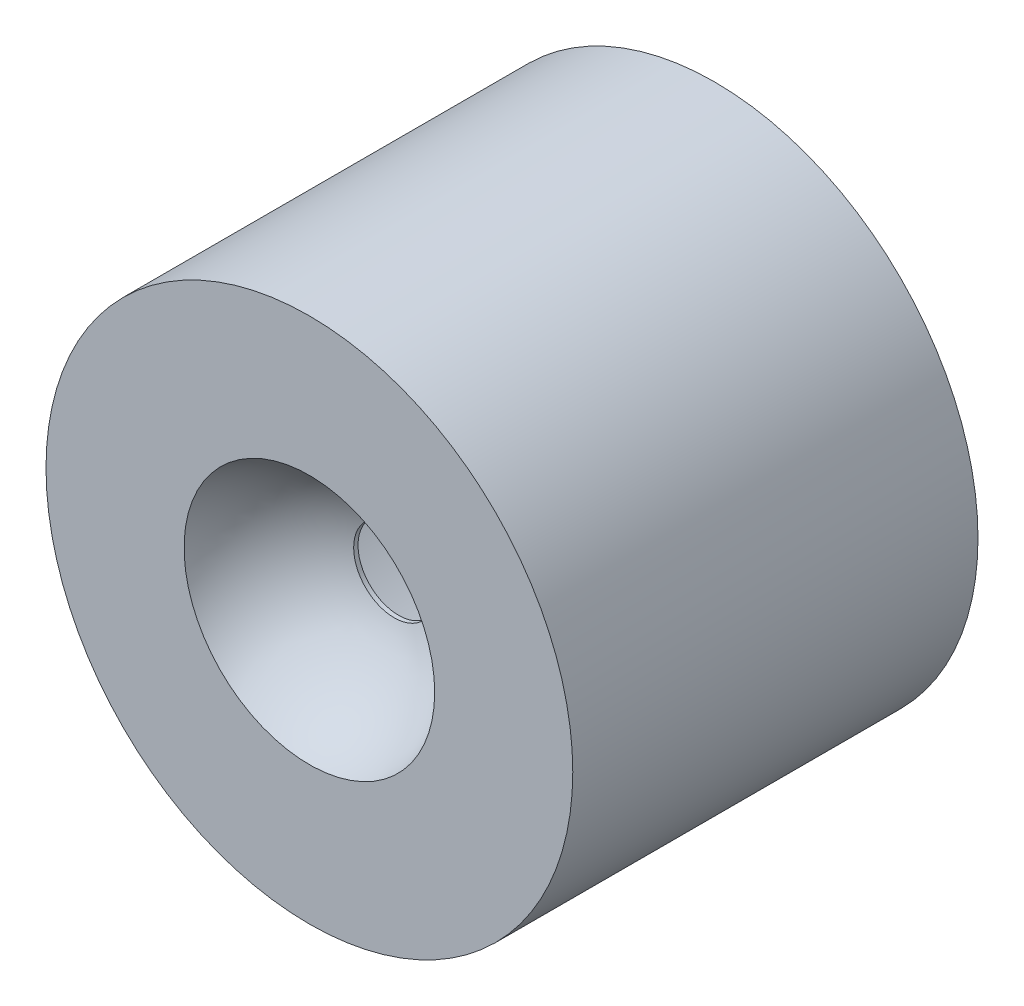
ISO-10303-21;
HEADER;
FILE_DESCRIPTION(('STEP AP214'),'2;1');
FILE_NAME('part.step','',(''),(''),'','','');
FILE_SCHEMA(('AUTOMOTIVE_DESIGN { 1 0 10303 214 1 1 1 1 }'));
ENDSEC;
DATA;
#1=APPLICATION_CONTEXT('core data for automotive mechanical design processes');
#2=APPLICATION_PROTOCOL_DEFINITION('international standard','automotive_design',2000,#1);
#3=PRODUCT_CONTEXT('',#1,'mechanical');
#4=PRODUCT('Part','Part','',(#3));
#5=PRODUCT_RELATED_PRODUCT_CATEGORY('part','',(#4));
#6=PRODUCT_DEFINITION_FORMATION('','',#4);
#7=PRODUCT_DEFINITION_CONTEXT('part definition',#1,'design');
#8=PRODUCT_DEFINITION('design','',#6,#7);
#9=PRODUCT_DEFINITION_SHAPE('','',#8);
#10=(LENGTH_UNIT() NAMED_UNIT(*) SI_UNIT(.MILLI.,.METRE.));
#11=(NAMED_UNIT(*) PLANE_ANGLE_UNIT() SI_UNIT($,.RADIAN.));
#12=(NAMED_UNIT(*) SI_UNIT($,.STERADIAN.) SOLID_ANGLE_UNIT());
#13=UNCERTAINTY_MEASURE_WITH_UNIT(LENGTH_MEASURE(1.E-05),#10,'distance_accuracy_value','');
#14=(GEOMETRIC_REPRESENTATION_CONTEXT(3) GLOBAL_UNCERTAINTY_ASSIGNED_CONTEXT((#13)) GLOBAL_UNIT_ASSIGNED_CONTEXT((#10,
#11,#12)) REPRESENTATION_CONTEXT('',''));
#15=CARTESIAN_POINT('',(0.,0.,0.));
#16=DIRECTION('',(0.,0.,1.));
#17=DIRECTION('',(1.,0.,0.));
#18=AXIS2_PLACEMENT_3D('',#15,#16,#17);
#19=CARTESIAN_POINT('',(0.,0.,55.));
#20=DIRECTION('',(1.,0.,0.));
#21=DIRECTION('',(0.,1.,0.));
#22=AXIS2_PLACEMENT_3D('',#19,#20,#21);
#23=SPHERICAL_SURFACE('',#22,16.25);
#24=CARTESIAN_POINT('',(0.,0.,55.));
#25=DIRECTION('',(0.,0.,1.));
#26=DIRECTION('',(1.,0.,0.));
#27=AXIS2_PLACEMENT_3D('',#24,#25,#26);
#28=SPHERICAL_SURFACE('',#27,16.25);
#29=CARTESIAN_POINT('',(0.,0.,39.5383539039338));
#30=DIRECTION('',(0.,0.,1.));
#31=DIRECTION('',(1.,0.,0.));
#32=AXIS2_PLACEMENT_3D('',#29,#30,#31);
#33=CIRCLE('',#32,5.);
#34=CARTESIAN_POINT('',(5.,0.,39.5383539039338));
#35=VERTEX_POINT('',#34);
#36=EDGE_CURVE('E66',#35,#35,#33,.F.);
#37=ORIENTED_EDGE('',*,*,#36,.T.);
#38=EDGE_LOOP('',(#37));
#39=FACE_BOUND('',#38,.T.);
#40=CARTESIAN_POINT('',(0.,0.,50.));
#41=DIRECTION('',(0.,0.,1.));
#42=DIRECTION('',(1.,0.,0.));
#43=AXIS2_PLACEMENT_3D('',#40,#41,#42);
#44=CIRCLE('',#43,15.4616460960662);
#45=CARTESIAN_POINT('',(15.4616460960662,0.,50.));
#46=VERTEX_POINT('',#45);
#47=EDGE_CURVE('E44',#46,#46,#44,.T.);
#48=ORIENTED_EDGE('',*,*,#47,.T.);
#49=EDGE_LOOP('',(#48));
#50=FACE_BOUND('',#49,.T.);
#51=ADVANCED_FACE('F33',(#39,#50),#28,.F.);
#52=CARTESIAN_POINT('',(0.,0.,60.));
#53=DIRECTION('',(0.,0.,-1.));
#54=DIRECTION('',(-1.,0.,0.));
#55=AXIS2_PLACEMENT_3D('',#52,#53,#54);
#56=CYLINDRICAL_SURFACE('',#55,32.5);
#57=CARTESIAN_POINT('',(0.,0.,0.));
#58=DIRECTION('',(0.,0.,1.));
#59=DIRECTION('',(1.,0.,0.));
#60=AXIS2_PLACEMENT_3D('',#57,#58,#59);
#61=CIRCLE('',#60,32.5);
#62=CARTESIAN_POINT('',(32.5,0.,0.));
#63=VERTEX_POINT('',#62);
#64=EDGE_CURVE('E10',#63,#63,#61,.T.);
#65=ORIENTED_EDGE('',*,*,#64,.T.);
#66=EDGE_LOOP('',(#65));
#67=FACE_BOUND('',#66,.T.);
#68=CARTESIAN_POINT('',(0.,0.,50.));
#69=DIRECTION('',(0.,0.,1.));
#70=DIRECTION('',(1.,0.,0.));
#71=AXIS2_PLACEMENT_3D('',#68,#69,#70);
#72=CIRCLE('',#71,32.5);
#73=CARTESIAN_POINT('',(32.5,0.,50.));
#74=VERTEX_POINT('',#73);
#75=EDGE_CURVE('E40',#74,#74,#72,.F.);
#76=ORIENTED_EDGE('',*,*,#75,.T.);
#77=EDGE_LOOP('',(#76));
#78=FACE_BOUND('',#77,.T.);
#79=ADVANCED_FACE('F35',(#67,#78),#56,.T.);
#80=CARTESIAN_POINT('',(0.,0.,0.));
#81=DIRECTION('',(0.,0.,1.));
#82=DIRECTION('',(1.,0.,0.));
#83=AXIS2_PLACEMENT_3D('',#80,#81,#82);
#84=PLANE('',#83);
#85=CARTESIAN_POINT('',(0.,0.,0.));
#86=DIRECTION('',(0.,0.,-1.));
#87=DIRECTION('',(-1.,0.,0.));
#88=AXIS2_PLACEMENT_3D('',#85,#86,#87);
#89=CIRCLE('',#88,30.);
#90=CARTESIAN_POINT('',(-30.,0.,0.));
#91=VERTEX_POINT('',#90);
#92=EDGE_CURVE('E51',#91,#91,#89,.T.);
#93=ORIENTED_EDGE('',*,*,#92,.F.);
#94=EDGE_LOOP('',(#93));
#95=FACE_BOUND('',#94,.T.);
#96=ORIENTED_EDGE('',*,*,#64,.F.);
#97=EDGE_LOOP('',(#96));
#98=FACE_BOUND('',#97,.T.);
#99=ADVANCED_FACE('F96',(#95,#98),#84,.F.);
#100=CARTESIAN_POINT('',(0.,0.,50.));
#101=DIRECTION('',(0.,0.,1.));
#102=DIRECTION('',(1.,0.,0.));
#103=AXIS2_PLACEMENT_3D('',#100,#101,#102);
#104=PLANE('',#103);
#105=ORIENTED_EDGE('',*,*,#75,.F.);
#106=EDGE_LOOP('',(#105));
#107=FACE_BOUND('',#106,.T.);
#108=ORIENTED_EDGE('',*,*,#47,.F.);
#109=EDGE_LOOP('',(#108));
#110=FACE_BOUND('',#109,.T.);
#111=ADVANCED_FACE('F82',(#107,#110),#104,.T.);
#112=CARTESIAN_POINT('',(0.,0.,39.));
#113=DIRECTION('',(0.,0.,-1.));
#114=DIRECTION('',(-1.,0.,0.));
#115=AXIS2_PLACEMENT_3D('',#112,#113,#114);
#116=PLANE('',#115);
#117=CARTESIAN_POINT('',(0.,0.,39.));
#118=DIRECTION('',(0.,0.,-1.));
#119=DIRECTION('',(-1.,0.,0.));
#120=AXIS2_PLACEMENT_3D('',#117,#118,#119);
#121=CIRCLE('',#120,5.);
#122=CARTESIAN_POINT('',(-5.,0.,39.));
#123=VERTEX_POINT('',#122);
#124=EDGE_CURVE('E71',#123,#123,#121,.T.);
#125=ORIENTED_EDGE('',*,*,#124,.F.);
#126=EDGE_LOOP('',(#125));
#127=FACE_BOUND('',#126,.T.);
#128=CARTESIAN_POINT('',(17.5,-9.00000000000001,39.));
#129=DIRECTION('',(0.,0.,-1.));
#130=DIRECTION('',(1.,0.,0.));
#131=AXIS2_PLACEMENT_3D('',#128,#129,#130);
#132=CIRCLE('',#131,1.);
#133=CARTESIAN_POINT('',(18.5,-9.00000000000001,39.));
#134=VERTEX_POINT('',#133);
#135=EDGE_CURVE('E63',#134,#134,#132,.T.);
#136=ORIENTED_EDGE('',*,*,#135,.F.);
#137=EDGE_LOOP('',(#136));
#138=FACE_BOUND('',#137,.T.);
#139=CARTESIAN_POINT('',(-17.5,-9.,39.));
#140=DIRECTION('',(0.,0.,-1.));
#141=DIRECTION('',(-1.,0.,0.));
#142=AXIS2_PLACEMENT_3D('',#139,#140,#141);
#143=CIRCLE('',#142,1.);
#144=CARTESIAN_POINT('',(-18.5,-9.,39.));
#145=VERTEX_POINT('',#144);
#146=EDGE_CURVE('E57',#145,#145,#143,.T.);
#147=ORIENTED_EDGE('',*,*,#146,.F.);
#148=EDGE_LOOP('',(#147));
#149=FACE_BOUND('',#148,.T.);
#150=CARTESIAN_POINT('',(0.,0.,39.));
#151=DIRECTION('',(0.,0.,-1.));
#152=DIRECTION('',(-1.,0.,0.));
#153=AXIS2_PLACEMENT_3D('',#150,#151,#152);
#154=CIRCLE('',#153,30.);
#155=CARTESIAN_POINT('',(-30.,0.,39.));
#156=VERTEX_POINT('',#155);
#157=EDGE_CURVE('E48',#156,#156,#154,.T.);
#158=ORIENTED_EDGE('',*,*,#157,.T.);
#159=EDGE_LOOP('',(#158));
#160=FACE_BOUND('',#159,.T.);
#161=ADVANCED_FACE('F78',(#127,#138,#149,#160),#116,.T.);
#162=CARTESIAN_POINT('',(0.,0.,39.));
#163=DIRECTION('',(0.,0.,-1.));
#164=DIRECTION('',(-1.,0.,0.));
#165=AXIS2_PLACEMENT_3D('',#162,#163,#164);
#166=CYLINDRICAL_SURFACE('',#165,30.);
#167=ORIENTED_EDGE('',*,*,#157,.F.);
#168=EDGE_LOOP('',(#167));
#169=FACE_BOUND('',#168,.T.);
#170=ORIENTED_EDGE('',*,*,#92,.T.);
#171=EDGE_LOOP('',(#170));
#172=FACE_BOUND('',#171,.T.);
#173=ADVANCED_FACE('F81',(#169,#172),#166,.F.);
#174=CARTESIAN_POINT('',(-17.5,-9.,34.));
#175=DIRECTION('',(0.,0.,1.));
#176=DIRECTION('',(1.,0.,0.));
#177=AXIS2_PLACEMENT_3D('',#174,#175,#176);
#178=CYLINDRICAL_SURFACE('',#177,1.);
#179=CARTESIAN_POINT('',(-17.5,-9.,34.));
#180=DIRECTION('',(0.,0.,-1.));
#181=DIRECTION('',(-1.,0.,0.));
#182=AXIS2_PLACEMENT_3D('',#179,#180,#181);
#183=CIRCLE('',#182,1.);
#184=CARTESIAN_POINT('',(-18.5,-9.,34.));
#185=VERTEX_POINT('',#184);
#186=EDGE_CURVE('E54',#185,#185,#183,.T.);
#187=ORIENTED_EDGE('',*,*,#186,.F.);
#188=EDGE_LOOP('',(#187));
#189=FACE_BOUND('',#188,.T.);
#190=ORIENTED_EDGE('',*,*,#146,.T.);
#191=EDGE_LOOP('',(#190));
#192=FACE_BOUND('',#191,.T.);
#193=ADVANCED_FACE('F92',(#189,#192),#178,.T.);
#194=CARTESIAN_POINT('',(-17.5,-9.,34.));
#195=DIRECTION('',(0.,0.,-1.));
#196=DIRECTION('',(-1.,0.,0.));
#197=AXIS2_PLACEMENT_3D('',#194,#195,#196);
#198=PLANE('',#197);
#199=ORIENTED_EDGE('',*,*,#186,.T.);
#200=EDGE_LOOP('',(#199));
#201=FACE_BOUND('',#200,.T.);
#202=ADVANCED_FACE('F115',(#201),#198,.T.);
#203=CARTESIAN_POINT('',(17.5,-9.00000000000001,34.));
#204=DIRECTION('',(0.,0.,1.));
#205=DIRECTION('',(1.,0.,0.));
#206=AXIS2_PLACEMENT_3D('',#203,#204,#205);
#207=CYLINDRICAL_SURFACE('',#206,1.);
#208=CARTESIAN_POINT('',(17.5,-9.00000000000001,34.));
#209=DIRECTION('',(0.,0.,-1.));
#210=DIRECTION('',(1.,0.,0.));
#211=AXIS2_PLACEMENT_3D('',#208,#209,#210);
#212=CIRCLE('',#211,1.);
#213=CARTESIAN_POINT('',(18.5,-9.00000000000001,34.));
#214=VERTEX_POINT('',#213);
#215=EDGE_CURVE('E60',#214,#214,#212,.T.);
#216=ORIENTED_EDGE('',*,*,#215,.F.);
#217=EDGE_LOOP('',(#216));
#218=FACE_BOUND('',#217,.T.);
#219=ORIENTED_EDGE('',*,*,#135,.T.);
#220=EDGE_LOOP('',(#219));
#221=FACE_BOUND('',#220,.T.);
#222=ADVANCED_FACE('F119',(#218,#221),#207,.T.);
#223=CARTESIAN_POINT('',(17.5,-9.00000000000001,34.));
#224=DIRECTION('',(0.,0.,1.));
#225=DIRECTION('',(1.,0.,0.));
#226=AXIS2_PLACEMENT_3D('',#223,#224,#225);
#227=PLANE('',#226);
#228=ORIENTED_EDGE('',*,*,#215,.T.);
#229=EDGE_LOOP('',(#228));
#230=FACE_BOUND('',#229,.T.);
#231=ADVANCED_FACE('F123',(#230),#227,.F.);
#232=CARTESIAN_POINT('',(0.,0.,40.));
#233=DIRECTION('',(0.,0.,-1.));
#234=DIRECTION('',(-1.,0.,0.));
#235=AXIS2_PLACEMENT_3D('',#232,#233,#234);
#236=CYLINDRICAL_SURFACE('',#235,5.);
#237=ORIENTED_EDGE('',*,*,#124,.T.);
#238=EDGE_LOOP('',(#237));
#239=FACE_BOUND('',#238,.T.);
#240=ORIENTED_EDGE('',*,*,#36,.F.);
#241=EDGE_LOOP('',(#240));
#242=FACE_BOUND('',#241,.T.);
#243=ADVANCED_FACE('F75',(#239,#242),#236,.F.);
#244=CLOSED_SHELL('',(#51,#79,#99,#111,#161,#173,#193,#202,#222,#231,#243));
#245=MANIFOLD_SOLID_BREP('B2',#244);
#246=ADVANCED_BREP_SHAPE_REPRESENTATION('',(#18,#245),#14);
#247=SHAPE_DEFINITION_REPRESENTATION(#9,#246);
ENDSEC;
END-ISO-10303-21;
